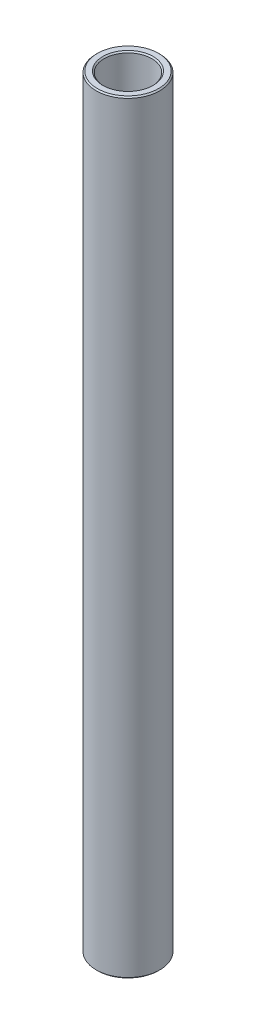
ISO-10303-21;
HEADER;
FILE_DESCRIPTION(('STEP AP214'),'2;1');
FILE_NAME('part.step','',(''),(''),'','','');
FILE_SCHEMA(('AUTOMOTIVE_DESIGN { 1 0 10303 214 1 1 1 1 }'));
ENDSEC;
DATA;
#1=APPLICATION_CONTEXT('core data for automotive mechanical design processes');
#2=APPLICATION_PROTOCOL_DEFINITION('international standard','automotive_design',2000,#1);
#3=PRODUCT_CONTEXT('',#1,'mechanical');
#4=PRODUCT('Part','Part','',(#3));
#5=PRODUCT_RELATED_PRODUCT_CATEGORY('part','',(#4));
#6=PRODUCT_DEFINITION_FORMATION('','',#4);
#7=PRODUCT_DEFINITION_CONTEXT('part definition',#1,'design');
#8=PRODUCT_DEFINITION('design','',#6,#7);
#9=PRODUCT_DEFINITION_SHAPE('','',#8);
#10=(LENGTH_UNIT() NAMED_UNIT(*) SI_UNIT(.MILLI.,.METRE.));
#11=(NAMED_UNIT(*) PLANE_ANGLE_UNIT() SI_UNIT($,.RADIAN.));
#12=(NAMED_UNIT(*) SI_UNIT($,.STERADIAN.) SOLID_ANGLE_UNIT());
#13=UNCERTAINTY_MEASURE_WITH_UNIT(LENGTH_MEASURE(1.E-05),#10,'distance_accuracy_value','');
#14=(GEOMETRIC_REPRESENTATION_CONTEXT(3) GLOBAL_UNCERTAINTY_ASSIGNED_CONTEXT((#13)) GLOBAL_UNIT_ASSIGNED_CONTEXT((#10,
#11,#12)) REPRESENTATION_CONTEXT('',''));
#15=CARTESIAN_POINT('',(0.,0.,0.));
#16=DIRECTION('',(0.,0.,1.));
#17=DIRECTION('',(1.,0.,0.));
#18=AXIS2_PLACEMENT_3D('',#15,#16,#17);
#19=CARTESIAN_POINT('',(0.,11.60859375,0.));
#20=DIRECTION('',(0.,1.,0.));
#21=DIRECTION('',(-1.,0.,0.));
#22=AXIS2_PLACEMENT_3D('',#19,#20,#21);
#23=CYLINDRICAL_SURFACE('',#22,4.76250000000001);
#24=CARTESIAN_POINT('',(0.,-75.946,0.));
#25=DIRECTION('',(0.,1.,0.));
#26=DIRECTION('',(-1.,0.,0.));
#27=AXIS2_PLACEMENT_3D('',#24,#25,#26);
#28=CIRCLE('',#27,4.76250000000001);
#29=CARTESIAN_POINT('',(-4.76250000000002,-75.946,0.));
#30=VERTEX_POINT('',#29);
#31=EDGE_CURVE('E51',#30,#30,#28,.F.);
#32=ORIENTED_EDGE('',*,*,#31,.T.);
#33=EDGE_LOOP('',(#32));
#34=FACE_BOUND('',#33,.T.);
#35=CARTESIAN_POINT('',(0.,75.9460000000001,0.));
#36=DIRECTION('',(0.,-1.,0.));
#37=DIRECTION('',(1.,0.,0.));
#38=AXIS2_PLACEMENT_3D('',#35,#36,#37);
#39=CIRCLE('',#38,4.76250000000001);
#40=CARTESIAN_POINT('',(4.76250000000002,75.9460000000001,0.));
#41=VERTEX_POINT('',#40);
#42=EDGE_CURVE('E54',#41,#41,#39,.F.);
#43=ORIENTED_EDGE('',*,*,#42,.T.);
#44=EDGE_LOOP('',(#43));
#45=FACE_BOUND('',#44,.T.);
#46=ADVANCED_FACE('F31',(#34,#45),#23,.F.);
#47=CARTESIAN_POINT('',(4.7625,76.2,0.));
#48=DIRECTION('',(0.,-1.,0.));
#49=DIRECTION('',(1.,0.,0.));
#50=AXIS2_PLACEMENT_3D('',#47,#48,#49);
#51=PLANE('',#50);
#52=CARTESIAN_POINT('',(0.,76.2,0.));
#53=DIRECTION('',(0.,-1.,0.));
#54=DIRECTION('',(1.,0.,0.));
#55=AXIS2_PLACEMENT_3D('',#52,#53,#54);
#56=CIRCLE('',#55,6.09599999999997);
#57=CARTESIAN_POINT('',(6.09599999999999,76.2,0.));
#58=VERTEX_POINT('',#57);
#59=EDGE_CURVE('E10',#58,#58,#56,.F.);
#60=ORIENTED_EDGE('',*,*,#59,.T.);
#61=EDGE_LOOP('',(#60));
#62=FACE_BOUND('',#61,.T.);
#63=CARTESIAN_POINT('',(0.,76.2,0.));
#64=DIRECTION('',(0.,-1.,0.));
#65=DIRECTION('',(1.,0.,0.));
#66=AXIS2_PLACEMENT_3D('',#63,#64,#65);
#67=CIRCLE('',#66,5.01649999999997);
#68=CARTESIAN_POINT('',(5.01649999999998,76.2,0.));
#69=VERTEX_POINT('',#68);
#70=EDGE_CURVE('E38',#69,#69,#67,.T.);
#71=ORIENTED_EDGE('',*,*,#70,.T.);
#72=EDGE_LOOP('',(#71));
#73=FACE_BOUND('',#72,.T.);
#74=ADVANCED_FACE('F77',(#62,#73),#51,.F.);
#75=CARTESIAN_POINT('',(0.,11.60859375,0.));
#76=DIRECTION('',(0.,1.,0.));
#77=DIRECTION('',(-1.,0.,0.));
#78=AXIS2_PLACEMENT_3D('',#75,#76,#77);
#79=CYLINDRICAL_SURFACE('',#78,6.35);
#80=CARTESIAN_POINT('',(0.,-75.9459999999999,0.));
#81=DIRECTION('',(0.,1.,0.));
#82=DIRECTION('',(-1.,0.,0.));
#83=AXIS2_PLACEMENT_3D('',#80,#81,#82);
#84=CIRCLE('',#83,6.35);
#85=CARTESIAN_POINT('',(-6.35000000000001,-75.9459999999999,0.));
#86=VERTEX_POINT('',#85);
#87=EDGE_CURVE('E42',#86,#86,#84,.T.);
#88=ORIENTED_EDGE('',*,*,#87,.T.);
#89=EDGE_LOOP('',(#88));
#90=FACE_BOUND('',#89,.T.);
#91=CARTESIAN_POINT('',(0.,75.946,0.));
#92=DIRECTION('',(0.,-1.,0.));
#93=DIRECTION('',(1.,0.,0.));
#94=AXIS2_PLACEMENT_3D('',#91,#92,#93);
#95=CIRCLE('',#94,6.35);
#96=CARTESIAN_POINT('',(6.35000000000001,75.946,0.));
#97=VERTEX_POINT('',#96);
#98=EDGE_CURVE('E46',#97,#97,#95,.T.);
#99=ORIENTED_EDGE('',*,*,#98,.T.);
#100=EDGE_LOOP('',(#99));
#101=FACE_BOUND('',#100,.T.);
#102=ADVANCED_FACE('F74',(#90,#101),#79,.T.);
#103=CARTESIAN_POINT('',(6.35000000000001,-76.2,0.));
#104=DIRECTION('',(0.,1.,0.));
#105=DIRECTION('',(-1.,0.,0.));
#106=AXIS2_PLACEMENT_3D('',#103,#104,#105);
#107=PLANE('',#106);
#108=CARTESIAN_POINT('',(0.,-76.2,0.));
#109=DIRECTION('',(0.,1.,0.));
#110=DIRECTION('',(-1.,0.,0.));
#111=AXIS2_PLACEMENT_3D('',#108,#109,#110);
#112=CIRCLE('',#111,5.01650000000003);
#113=CARTESIAN_POINT('',(-5.01650000000004,-76.2,0.));
#114=VERTEX_POINT('',#113);
#115=EDGE_CURVE('E57',#114,#114,#112,.T.);
#116=ORIENTED_EDGE('',*,*,#115,.T.);
#117=EDGE_LOOP('',(#116));
#118=FACE_BOUND('',#117,.T.);
#119=CARTESIAN_POINT('',(0.,-76.2,0.));
#120=DIRECTION('',(0.,1.,0.));
#121=DIRECTION('',(-1.,0.,0.));
#122=AXIS2_PLACEMENT_3D('',#119,#120,#121);
#123=CIRCLE('',#122,6.09599999999993);
#124=CARTESIAN_POINT('',(-6.09599999999994,-76.2,0.));
#125=VERTEX_POINT('',#124);
#126=EDGE_CURVE('E60',#125,#125,#123,.F.);
#127=ORIENTED_EDGE('',*,*,#126,.T.);
#128=EDGE_LOOP('',(#127));
#129=FACE_BOUND('',#128,.T.);
#130=ADVANCED_FACE('F64',(#118,#129),#107,.F.);
#131=CARTESIAN_POINT('',(0.,-76.2,0.));
#132=DIRECTION('',(0.,-1.,0.));
#133=DIRECTION('',(1.,0.,0.));
#134=AXIS2_PLACEMENT_3D('',#131,#132,#133);
#135=CONICAL_SURFACE('',#134,5.01650000000003,0.785398163397431);
#136=ORIENTED_EDGE('',*,*,#31,.F.);
#137=EDGE_LOOP('',(#136));
#138=FACE_BOUND('',#137,.T.);
#139=ORIENTED_EDGE('',*,*,#115,.F.);
#140=EDGE_LOOP('',(#139));
#141=FACE_BOUND('',#140,.T.);
#142=ADVANCED_FACE('F70',(#138,#141),#135,.F.);
#143=CARTESIAN_POINT('',(0.,-75.9459999999999,0.));
#144=DIRECTION('',(0.,1.,0.));
#145=DIRECTION('',(-1.,0.,0.));
#146=AXIS2_PLACEMENT_3D('',#143,#144,#145);
#147=CONICAL_SURFACE('',#146,6.35,0.785398163397431);
#148=ORIENTED_EDGE('',*,*,#126,.F.);
#149=EDGE_LOOP('',(#148));
#150=FACE_BOUND('',#149,.T.);
#151=ORIENTED_EDGE('',*,*,#87,.F.);
#152=EDGE_LOOP('',(#151));
#153=FACE_BOUND('',#152,.T.);
#154=ADVANCED_FACE('F66',(#150,#153),#147,.T.);
#155=CARTESIAN_POINT('',(0.,76.2,0.));
#156=DIRECTION('',(0.,-1.,0.));
#157=DIRECTION('',(1.,0.,0.));
#158=AXIS2_PLACEMENT_3D('',#155,#156,#157);
#159=CONICAL_SURFACE('',#158,6.09599999999998,0.785398163397458);
#160=ORIENTED_EDGE('',*,*,#98,.F.);
#161=EDGE_LOOP('',(#160));
#162=FACE_BOUND('',#161,.T.);
#163=ORIENTED_EDGE('',*,*,#59,.F.);
#164=EDGE_LOOP('',(#163));
#165=FACE_BOUND('',#164,.T.);
#166=ADVANCED_FACE('F69',(#162,#165),#159,.T.);
#167=CARTESIAN_POINT('',(0.,75.9460000000001,0.));
#168=DIRECTION('',(0.,1.,0.));
#169=DIRECTION('',(-1.,0.,0.));
#170=AXIS2_PLACEMENT_3D('',#167,#168,#169);
#171=CONICAL_SURFACE('',#170,4.76250000000001,0.785398163397458);
#172=ORIENTED_EDGE('',*,*,#70,.F.);
#173=EDGE_LOOP('',(#172));
#174=FACE_BOUND('',#173,.T.);
#175=ORIENTED_EDGE('',*,*,#42,.F.);
#176=EDGE_LOOP('',(#175));
#177=FACE_BOUND('',#176,.T.);
#178=ADVANCED_FACE('F33',(#174,#177),#171,.F.);
#179=CLOSED_SHELL('',(#46,#74,#102,#130,#142,#154,#166,#178));
#180=MANIFOLD_SOLID_BREP('B2',#179);
#181=ADVANCED_BREP_SHAPE_REPRESENTATION('',(#18,#180),#14);
#182=SHAPE_DEFINITION_REPRESENTATION(#9,#181);
ENDSEC;
END-ISO-10303-21;
